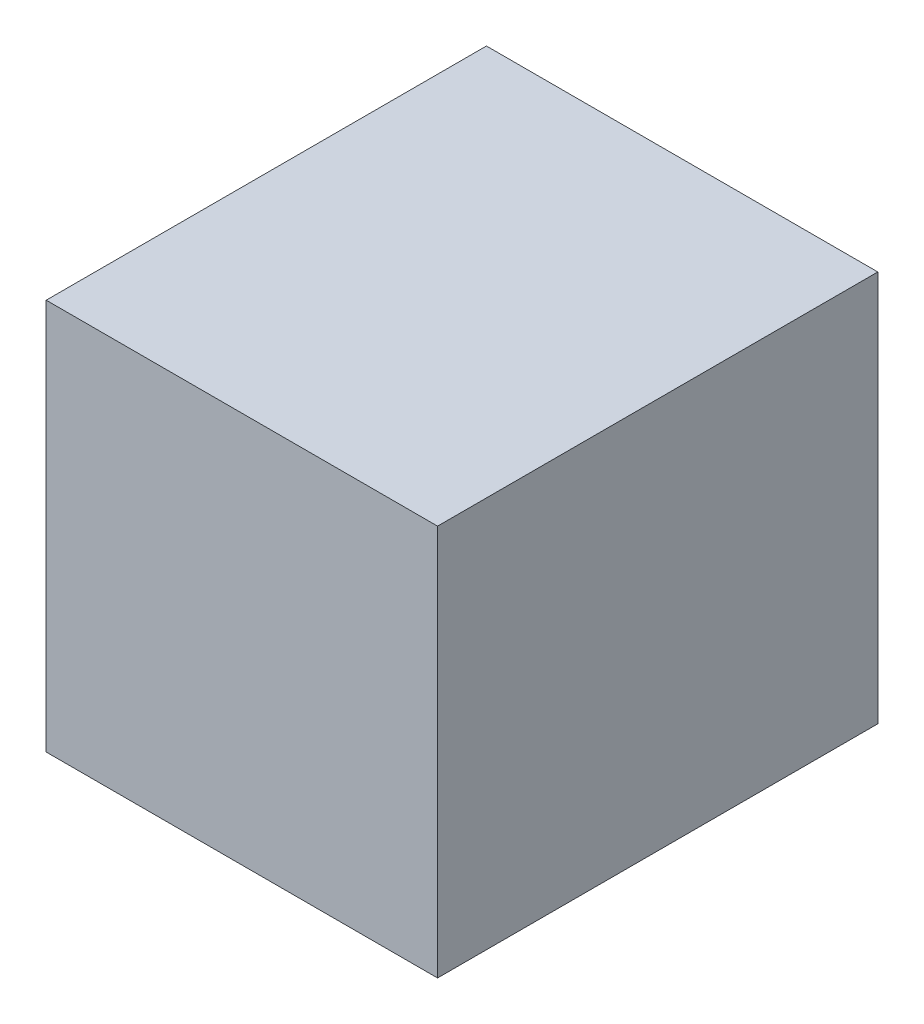
ISO-10303-21;
HEADER;
FILE_DESCRIPTION(('STEP AP214'),'2;1');
FILE_NAME('part.step','',(''),(''),'','','');
FILE_SCHEMA(('AUTOMOTIVE_DESIGN { 1 0 10303 214 1 1 1 1 }'));
ENDSEC;
DATA;
#1=APPLICATION_CONTEXT('core data for automotive mechanical design processes');
#2=APPLICATION_PROTOCOL_DEFINITION('international standard','automotive_design',2000,#1);
#3=PRODUCT_CONTEXT('',#1,'mechanical');
#4=PRODUCT('Part','Part','',(#3));
#5=PRODUCT_RELATED_PRODUCT_CATEGORY('part','',(#4));
#6=PRODUCT_DEFINITION_FORMATION('','',#4);
#7=PRODUCT_DEFINITION_CONTEXT('part definition',#1,'design');
#8=PRODUCT_DEFINITION('design','',#6,#7);
#9=PRODUCT_DEFINITION_SHAPE('','',#8);
#10=(LENGTH_UNIT() NAMED_UNIT(*) SI_UNIT(.MILLI.,.METRE.));
#11=(NAMED_UNIT(*) PLANE_ANGLE_UNIT() SI_UNIT($,.RADIAN.));
#12=(NAMED_UNIT(*) SI_UNIT($,.STERADIAN.) SOLID_ANGLE_UNIT());
#13=UNCERTAINTY_MEASURE_WITH_UNIT(LENGTH_MEASURE(1.E-05),#10,'distance_accuracy_value','');
#14=(GEOMETRIC_REPRESENTATION_CONTEXT(3) GLOBAL_UNCERTAINTY_ASSIGNED_CONTEXT((#13)) GLOBAL_UNIT_ASSIGNED_CONTEXT((#10,
#11,#12)) REPRESENTATION_CONTEXT('',''));
#15=CARTESIAN_POINT('',(0.,0.,0.));
#16=DIRECTION('',(0.,0.,1.));
#17=DIRECTION('',(1.,0.,0.));
#18=AXIS2_PLACEMENT_3D('',#15,#16,#17);
#19=CARTESIAN_POINT('',(0.4000373,0.3999992,0.));
#20=DIRECTION('',(0.,-1.,0.));
#21=DIRECTION('',(0.,0.,-1.));
#22=AXIS2_PLACEMENT_3D('',#19,#20,#21);
#23=PLANE('',#22);
#24=DIRECTION('',(0.,0.,-1.));
#25=VECTOR('',#24,1.);
#26=CARTESIAN_POINT('',(-0.40003476,0.3999992,0.));
#27=LINE('',#26,#25);
#28=CARTESIAN_POINT('',(-0.40003476,0.3999992,0.));
#29=VERTEX_POINT('',#28);
#30=CARTESIAN_POINT('',(-0.40003476,0.3999992,0.90000074));
#31=VERTEX_POINT('',#30);
#32=EDGE_CURVE('E20',#29,#31,#27,.F.);
#33=ORIENTED_EDGE('',*,*,#32,.T.);
#34=DIRECTION('',(-1.,0.,0.));
#35=VECTOR('',#34,1.);
#36=CARTESIAN_POINT('',(-0.40003476,0.3999992,0.90000074));
#37=LINE('',#36,#35);
#38=CARTESIAN_POINT('',(0.4000373,0.3999992,0.90000074));
#39=VERTEX_POINT('',#38);
#40=EDGE_CURVE('E55',#31,#39,#37,.F.);
#41=ORIENTED_EDGE('',*,*,#40,.T.);
#42=DIRECTION('',(0.,0.,1.));
#43=VECTOR('',#42,1.);
#44=CARTESIAN_POINT('',(0.4000373,0.3999992,0.));
#45=LINE('',#44,#43);
#46=CARTESIAN_POINT('',(0.4000373,0.3999992,0.));
#47=VERTEX_POINT('',#46);
#48=EDGE_CURVE('E74',#39,#47,#45,.F.);
#49=ORIENTED_EDGE('',*,*,#48,.T.);
#50=DIRECTION('',(-1.,0.,0.));
#51=VECTOR('',#50,1.);
#52=CARTESIAN_POINT('',(-0.40003476,0.3999992,0.));
#53=LINE('',#52,#51);
#54=EDGE_CURVE('E66',#29,#47,#53,.F.);
#55=ORIENTED_EDGE('',*,*,#54,.F.);
#56=EDGE_LOOP('',(#33,#41,#49,#55));
#57=FACE_BOUND('',#56,.T.);
#58=ADVANCED_FACE('F17',(#57),#23,.F.);
#59=CARTESIAN_POINT('',(-0.40003476,0.3999992,0.));
#60=DIRECTION('',(1.,0.,0.));
#61=DIRECTION('',(0.,0.,-1.));
#62=AXIS2_PLACEMENT_3D('',#59,#60,#61);
#63=PLANE('',#62);
#64=DIRECTION('',(0.,0.,1.));
#65=VECTOR('',#64,1.);
#66=CARTESIAN_POINT('',(-0.40003476,-0.3999992,0.));
#67=LINE('',#66,#65);
#68=CARTESIAN_POINT('',(-0.40003476,-0.3999992,0.));
#69=VERTEX_POINT('',#68);
#70=CARTESIAN_POINT('',(-0.40003476,-0.3999992,0.90000074));
#71=VERTEX_POINT('',#70);
#72=EDGE_CURVE('E72',#69,#71,#67,.T.);
#73=ORIENTED_EDGE('',*,*,#72,.T.);
#74=DIRECTION('',(0.,1.,0.));
#75=VECTOR('',#74,1.);
#76=CARTESIAN_POINT('',(-0.40003476,0.3999992,0.90000074));
#77=LINE('',#76,#75);
#78=EDGE_CURVE('E62',#71,#31,#77,.T.);
#79=ORIENTED_EDGE('',*,*,#78,.T.);
#80=ORIENTED_EDGE('',*,*,#32,.F.);
#81=DIRECTION('',(0.,1.,0.));
#82=VECTOR('',#81,1.);
#83=CARTESIAN_POINT('',(-0.40003476,0.3999992,0.));
#84=LINE('',#83,#82);
#85=EDGE_CURVE('E80',#69,#29,#84,.T.);
#86=ORIENTED_EDGE('',*,*,#85,.F.);
#87=EDGE_LOOP('',(#73,#79,#80,#86));
#88=FACE_BOUND('',#87,.T.);
#89=ADVANCED_FACE('F71',(#88),#63,.F.);
#90=CARTESIAN_POINT('',(-0.40003476,0.3999992,0.90000074));
#91=DIRECTION('',(0.,0.,-1.));
#92=DIRECTION('',(-1.,0.,0.));
#93=AXIS2_PLACEMENT_3D('',#90,#91,#92);
#94=PLANE('',#93);
#95=DIRECTION('',(1.,0.,0.));
#96=VECTOR('',#95,1.);
#97=CARTESIAN_POINT('',(-0.40003476,-0.3999992,0.90000074));
#98=LINE('',#97,#96);
#99=CARTESIAN_POINT('',(0.4000373,-0.3999992,0.90000074));
#100=VERTEX_POINT('',#99);
#101=EDGE_CURVE('E83',#71,#100,#98,.T.);
#102=ORIENTED_EDGE('',*,*,#101,.T.);
#103=DIRECTION('',(0.,1.,0.));
#104=VECTOR('',#103,1.);
#105=CARTESIAN_POINT('',(0.4000373,-0.3999992,0.90000074));
#106=LINE('',#105,#104);
#107=EDGE_CURVE('E64',#100,#39,#106,.T.);
#108=ORIENTED_EDGE('',*,*,#107,.T.);
#109=ORIENTED_EDGE('',*,*,#40,.F.);
#110=ORIENTED_EDGE('',*,*,#78,.F.);
#111=EDGE_LOOP('',(#102,#108,#109,#110));
#112=FACE_BOUND('',#111,.T.);
#113=ADVANCED_FACE('F60',(#112),#94,.F.);
#114=CARTESIAN_POINT('',(0.4000373,-0.3999992,0.));
#115=DIRECTION('',(-1.,0.,0.));
#116=DIRECTION('',(0.,0.,1.));
#117=AXIS2_PLACEMENT_3D('',#114,#115,#116);
#118=PLANE('',#117);
#119=ORIENTED_EDGE('',*,*,#48,.F.);
#120=ORIENTED_EDGE('',*,*,#107,.F.);
#121=DIRECTION('',(0.,0.,1.));
#122=VECTOR('',#121,1.);
#123=CARTESIAN_POINT('',(0.4000373,-0.3999992,0.));
#124=LINE('',#123,#122);
#125=CARTESIAN_POINT('',(0.4000373,-0.3999992,0.));
#126=VERTEX_POINT('',#125);
#127=EDGE_CURVE('E26',#100,#126,#124,.F.);
#128=ORIENTED_EDGE('',*,*,#127,.T.);
#129=DIRECTION('',(0.,1.,0.));
#130=VECTOR('',#129,1.);
#131=CARTESIAN_POINT('',(0.4000373,0.3999992,0.));
#132=LINE('',#131,#130);
#133=EDGE_CURVE('E34',#47,#126,#132,.F.);
#134=ORIENTED_EDGE('',*,*,#133,.F.);
#135=EDGE_LOOP('',(#119,#120,#128,#134));
#136=FACE_BOUND('',#135,.T.);
#137=ADVANCED_FACE('F88',(#136),#118,.F.);
#138=CARTESIAN_POINT('',(-0.40003476,0.3999992,0.));
#139=DIRECTION('',(0.,0.,-1.));
#140=DIRECTION('',(-1.,0.,0.));
#141=AXIS2_PLACEMENT_3D('',#138,#139,#140);
#142=PLANE('',#141);
#143=DIRECTION('',(1.,0.,0.));
#144=VECTOR('',#143,1.);
#145=CARTESIAN_POINT('',(-0.40003476,-0.3999992,0.));
#146=LINE('',#145,#144);
#147=EDGE_CURVE('E11',#126,#69,#146,.F.);
#148=ORIENTED_EDGE('',*,*,#147,.T.);
#149=ORIENTED_EDGE('',*,*,#85,.T.);
#150=ORIENTED_EDGE('',*,*,#54,.T.);
#151=ORIENTED_EDGE('',*,*,#133,.T.);
#152=EDGE_LOOP('',(#148,#149,#150,#151));
#153=FACE_BOUND('',#152,.T.);
#154=ADVANCED_FACE('F91',(#153),#142,.T.);
#155=CARTESIAN_POINT('',(-0.40003476,-0.3999992,0.));
#156=DIRECTION('',(0.,1.,0.));
#157=DIRECTION('',(0.,0.,1.));
#158=AXIS2_PLACEMENT_3D('',#155,#156,#157);
#159=PLANE('',#158);
#160=ORIENTED_EDGE('',*,*,#127,.F.);
#161=ORIENTED_EDGE('',*,*,#101,.F.);
#162=ORIENTED_EDGE('',*,*,#72,.F.);
#163=ORIENTED_EDGE('',*,*,#147,.F.);
#164=EDGE_LOOP('',(#160,#161,#162,#163));
#165=FACE_BOUND('',#164,.T.);
#166=ADVANCED_FACE('F90',(#165),#159,.F.);
#167=CLOSED_SHELL('',(#58,#89,#113,#137,#154,#166));
#168=MANIFOLD_SOLID_BREP('B1',#167);
#169=ADVANCED_BREP_SHAPE_REPRESENTATION('',(#18,#168),#14);
#170=SHAPE_DEFINITION_REPRESENTATION(#9,#169);
ENDSEC;
END-ISO-10303-21;
